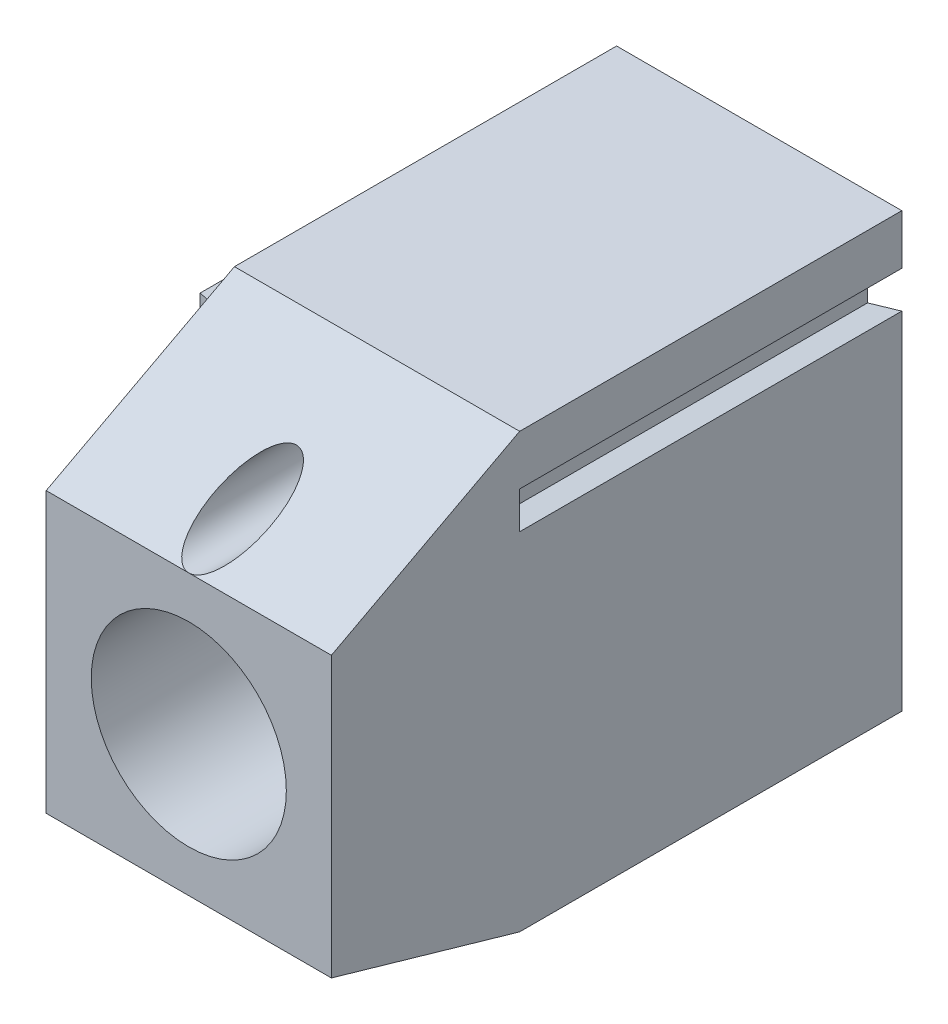
ISO-10303-21;
HEADER;
FILE_DESCRIPTION(('STEP AP214'),'2;1');
FILE_NAME('part.step','',(''),(''),'','','');
FILE_SCHEMA(('AUTOMOTIVE_DESIGN { 1 0 10303 214 1 1 1 1 }'));
ENDSEC;
DATA;
#1=APPLICATION_CONTEXT('core data for automotive mechanical design processes');
#2=APPLICATION_PROTOCOL_DEFINITION('international standard','automotive_design',2000,#1);
#3=PRODUCT_CONTEXT('',#1,'mechanical');
#4=PRODUCT('Part','Part','',(#3));
#5=PRODUCT_RELATED_PRODUCT_CATEGORY('part','',(#4));
#6=PRODUCT_DEFINITION_FORMATION('','',#4);
#7=PRODUCT_DEFINITION_CONTEXT('part definition',#1,'design');
#8=PRODUCT_DEFINITION('design','',#6,#7);
#9=PRODUCT_DEFINITION_SHAPE('','',#8);
#10=(LENGTH_UNIT() NAMED_UNIT(*) SI_UNIT(.MILLI.,.METRE.));
#11=(NAMED_UNIT(*) PLANE_ANGLE_UNIT() SI_UNIT($,.RADIAN.));
#12=(NAMED_UNIT(*) SI_UNIT($,.STERADIAN.) SOLID_ANGLE_UNIT());
#13=UNCERTAINTY_MEASURE_WITH_UNIT(LENGTH_MEASURE(1.E-05),#10,'distance_accuracy_value','');
#14=(GEOMETRIC_REPRESENTATION_CONTEXT(3) GLOBAL_UNCERTAINTY_ASSIGNED_CONTEXT((#13)) GLOBAL_UNIT_ASSIGNED_CONTEXT((#10,
#11,#12)) REPRESENTATION_CONTEXT('',''));
#15=CARTESIAN_POINT('',(0.,0.,0.));
#16=DIRECTION('',(0.,0.,1.));
#17=DIRECTION('',(1.,0.,0.));
#18=AXIS2_PLACEMENT_3D('',#15,#16,#17);
#19=CARTESIAN_POINT('',(1.42,-3.4,5.79));
#20=DIRECTION('',(1.,0.,0.));
#21=DIRECTION('',(0.,0.,-1.));
#22=AXIS2_PLACEMENT_3D('',#19,#20,#21);
#23=PLANE('',#22);
#24=DIRECTION('',(0.,1.,0.));
#25=VECTOR('',#24,1.);
#26=CARTESIAN_POINT('',(1.42,-3.4,5.79000000000001));
#27=LINE('',#26,#25);
#28=CARTESIAN_POINT('',(1.42,3.3,5.79));
#29=VERTEX_POINT('',#28);
#30=CARTESIAN_POINT('',(1.42,2.07,5.79000000000001));
#31=VERTEX_POINT('',#30);
#32=EDGE_CURVE('E275',#29,#31,#27,.F.);
#33=ORIENTED_EDGE('',*,*,#32,.F.);
#34=DIRECTION('',(0.,0.,-1.));
#35=VECTOR('',#34,1.);
#36=CARTESIAN_POINT('',(1.42,3.3,3.315));
#37=LINE('',#36,#35);
#38=CARTESIAN_POINT('',(1.42,3.3,0.840000000000001));
#39=VERTEX_POINT('',#38);
#40=EDGE_CURVE('E184',#39,#29,#37,.F.);
#41=ORIENTED_EDGE('',*,*,#40,.F.);
#42=DIRECTION('',(0.,1.,0.));
#43=VECTOR('',#42,1.);
#44=CARTESIAN_POINT('',(1.42,-3.4,0.840000000000002));
#45=LINE('',#44,#43);
#46=CARTESIAN_POINT('',(1.42,2.07,0.840000000000002));
#47=VERTEX_POINT('',#46);
#48=EDGE_CURVE('E273',#47,#39,#45,.T.);
#49=ORIENTED_EDGE('',*,*,#48,.F.);
#50=DIRECTION('',(0.,0.,1.));
#51=VECTOR('',#50,1.);
#52=CARTESIAN_POINT('',(1.42,2.07,3.315));
#53=LINE('',#52,#51);
#54=EDGE_CURVE('E233',#47,#31,#53,.T.);
#55=ORIENTED_EDGE('',*,*,#54,.T.);
#56=EDGE_LOOP('',(#33,#41,#49,#55));
#57=FACE_BOUND('',#56,.T.);
#58=ADVANCED_FACE('F16',(#57),#23,.F.);
#59=CARTESIAN_POINT('',(-1.42,-3.4,0.84));
#60=DIRECTION('',(-1.,0.,0.));
#61=DIRECTION('',(0.,0.,1.));
#62=AXIS2_PLACEMENT_3D('',#59,#60,#61);
#63=PLANE('',#62);
#64=DIRECTION('',(0.,1.,0.));
#65=VECTOR('',#64,1.);
#66=CARTESIAN_POINT('',(-1.42,-3.4,0.840000000000003));
#67=LINE('',#66,#65);
#68=CARTESIAN_POINT('',(-1.42,3.3,0.840000000000002));
#69=VERTEX_POINT('',#68);
#70=CARTESIAN_POINT('',(-1.42,2.07,0.840000000000003));
#71=VERTEX_POINT('',#70);
#72=EDGE_CURVE('E288',#69,#71,#67,.F.);
#73=ORIENTED_EDGE('',*,*,#72,.F.);
#74=DIRECTION('',(0.,0.,-1.));
#75=VECTOR('',#74,1.);
#76=CARTESIAN_POINT('',(-1.42,3.3,3.315));
#77=LINE('',#76,#75);
#78=CARTESIAN_POINT('',(-1.42,3.3,5.79));
#79=VERTEX_POINT('',#78);
#80=EDGE_CURVE('E183',#79,#69,#77,.T.);
#81=ORIENTED_EDGE('',*,*,#80,.F.);
#82=DIRECTION('',(0.,1.,0.));
#83=VECTOR('',#82,1.);
#84=CARTESIAN_POINT('',(-1.42,-3.4,5.79));
#85=LINE('',#84,#83);
#86=CARTESIAN_POINT('',(-1.42,2.07,5.79));
#87=VERTEX_POINT('',#86);
#88=EDGE_CURVE('E194',#87,#79,#85,.T.);
#89=ORIENTED_EDGE('',*,*,#88,.F.);
#90=DIRECTION('',(0.,0.,1.));
#91=VECTOR('',#90,1.);
#92=CARTESIAN_POINT('',(-1.42,2.07,3.315));
#93=LINE('',#92,#91);
#94=EDGE_CURVE('E234',#87,#71,#93,.F.);
#95=ORIENTED_EDGE('',*,*,#94,.T.);
#96=EDGE_LOOP('',(#73,#81,#89,#95));
#97=FACE_BOUND('',#96,.T.);
#98=ADVANCED_FACE('F583',(#97),#63,.F.);
#99=CARTESIAN_POINT('',(1.9,3.5,0.));
#100=DIRECTION('',(-1.,0.,0.));
#101=DIRECTION('',(0.,0.,1.));
#102=AXIS2_PLACEMENT_3D('',#99,#100,#101);
#103=PLANE('',#102);
#104=DIRECTION('',(0.,0.,1.));
#105=VECTOR('',#104,1.);
#106=CARTESIAN_POINT('',(1.9,3.5,0.));
#107=LINE('',#106,#105);
#108=CARTESIAN_POINT('',(1.9,3.5,0.));
#109=VERTEX_POINT('',#108);
#110=CARTESIAN_POINT('',(1.9,3.5,6.7));
#111=VERTEX_POINT('',#110);
#112=EDGE_CURVE('E303',#109,#111,#107,.T.);
#113=ORIENTED_EDGE('',*,*,#112,.T.);
#114=DIRECTION('',(0.,1.,0.));
#115=VECTOR('',#114,1.);
#116=CARTESIAN_POINT('',(1.9,3.5,6.7));
#117=LINE('',#116,#115);
#118=CARTESIAN_POINT('',(1.9,2.5,6.7));
#119=VERTEX_POINT('',#118);
#120=EDGE_CURVE('E291',#119,#111,#117,.T.);
#121=ORIENTED_EDGE('',*,*,#120,.F.);
#122=DIRECTION('',(0.,0.,1.));
#123=VECTOR('',#122,1.);
#124=CARTESIAN_POINT('',(1.9,2.5,0.));
#125=LINE('',#124,#123);
#126=CARTESIAN_POINT('',(1.9,2.5,0.));
#127=VERTEX_POINT('',#126);
#128=EDGE_CURVE('E264',#119,#127,#125,.F.);
#129=ORIENTED_EDGE('',*,*,#128,.T.);
#130=DIRECTION('',(0.,1.,0.));
#131=VECTOR('',#130,1.);
#132=CARTESIAN_POINT('',(1.9,3.5,0.));
#133=LINE('',#132,#131);
#134=EDGE_CURVE('E255',#109,#127,#133,.F.);
#135=ORIENTED_EDGE('',*,*,#134,.F.);
#136=EDGE_LOOP('',(#113,#121,#129,#135));
#137=FACE_BOUND('',#136,.T.);
#138=ADVANCED_FACE('F581',(#137),#103,.F.);
#139=CARTESIAN_POINT('',(0.,2.95,5.79));
#140=DIRECTION('',(0.,0.,1.));
#141=DIRECTION('',(1.,0.,0.));
#142=AXIS2_PLACEMENT_3D('',#139,#140,#141);
#143=PLANE('',#142);
#144=DIRECTION('',(1.,0.,0.));
#145=VECTOR('',#144,1.);
#146=CARTESIAN_POINT('',(0.,3.3,5.79000000000001));
#147=LINE('',#146,#145);
#148=CARTESIAN_POINT('',(0.357071421427143,3.3,5.79000000000001));
#149=VERTEX_POINT('',#148);
#150=CARTESIAN_POINT('',(-0.357071421427143,3.3,5.79000000000001));
#151=VERTEX_POINT('',#150);
#152=EDGE_CURVE('E173',#149,#151,#147,.F.);
#153=ORIENTED_EDGE('',*,*,#152,.F.);
#154=CARTESIAN_POINT('',(0.,2.95,5.79000000000001));
#155=DIRECTION('',(0.,0.,-1.));
#156=DIRECTION('',(-1.,0.,0.));
#157=AXIS2_PLACEMENT_3D('',#154,#155,#156);
#158=CIRCLE('',#157,0.5);
#159=EDGE_CURVE('E19',#149,#151,#158,.F.);
#160=ORIENTED_EDGE('',*,*,#159,.T.);
#161=EDGE_LOOP('',(#153,#160));
#162=FACE_BOUND('',#161,.T.);
#163=ADVANCED_FACE('F186',(#162),#143,.T.);
#164=CARTESIAN_POINT('',(0.,2.07,3.315));
#165=DIRECTION('',(0.,1.,0.));
#166=DIRECTION('',(0.,0.,1.));
#167=AXIS2_PLACEMENT_3D('',#164,#165,#166);
#168=PLANE('',#167);
#169=DIRECTION('',(1.,0.,0.));
#170=VECTOR('',#169,1.);
#171=CARTESIAN_POINT('',(0.,2.07,5.79));
#172=LINE('',#171,#170);
#173=CARTESIAN_POINT('',(-2.02,2.07,5.79));
#174=VERTEX_POINT('',#173);
#175=EDGE_CURVE('E245',#174,#87,#172,.T.);
#176=ORIENTED_EDGE('',*,*,#175,.F.);
#177=DIRECTION('',(0.,0.,1.));
#178=VECTOR('',#177,1.);
#179=CARTESIAN_POINT('',(-2.02,2.07,0.839999999999999));
#180=LINE('',#179,#178);
#181=CARTESIAN_POINT('',(-2.02,2.07,0.840000000000001));
#182=VERTEX_POINT('',#181);
#183=EDGE_CURVE('E200',#174,#182,#180,.F.);
#184=ORIENTED_EDGE('',*,*,#183,.T.);
#185=DIRECTION('',(1.,0.,0.));
#186=VECTOR('',#185,1.);
#187=CARTESIAN_POINT('',(0.,2.07,0.840000000000001));
#188=LINE('',#187,#186);
#189=EDGE_CURVE('E247',#71,#182,#188,.F.);
#190=ORIENTED_EDGE('',*,*,#189,.F.);
#191=ORIENTED_EDGE('',*,*,#94,.F.);
#192=EDGE_LOOP('',(#176,#184,#190,#191));
#193=FACE_BOUND('',#192,.T.);
#194=ADVANCED_FACE('F574',(#193),#168,.F.);
#195=CARTESIAN_POINT('',(0.,0.,6.10000000096989));
#196=DIRECTION('',(0.,0.,1.));
#197=DIRECTION('',(1.,0.,0.));
#198=AXIS2_PLACEMENT_3D('',#195,#196,#197);
#199=CONICAL_SURFACE('',#198,1.7099999992638,1.0297442574662);
#200=CARTESIAN_POINT('',(0.,0.,6.1));
#201=DIRECTION('',(0.,0.,1.));
#202=DIRECTION('',(1.,0.,0.));
#203=AXIS2_PLACEMENT_3D('',#200,#201,#202);
#204=CIRCLE('',#203,1.71);
#205=CARTESIAN_POINT('',(1.71,0.,6.1));
#206=VERTEX_POINT('',#205);
#207=EDGE_CURVE('E187',#206,#206,#204,.T.);
#208=ORIENTED_EDGE('',*,*,#207,.T.);
#209=EDGE_LOOP('',(#208));
#210=FACE_BOUND('',#209,.T.);
#211=CARTESIAN_POINT('',(0.,0.,5.79000000042247));
#212=DIRECTION('',(0.,0.,1.));
#213=DIRECTION('',(1.,0.,0.));
#214=AXIS2_PLACEMENT_3D('',#211,#212,#213);
#215=CIRCLE('',#214,1.19407336023869);
#216=CARTESIAN_POINT('',(1.19407336023869,0.,5.79000000042247));
#217=VERTEX_POINT('',#216);
#218=EDGE_CURVE('E203',#217,#217,#215,.F.);
#219=ORIENTED_EDGE('',*,*,#218,.T.);
#220=EDGE_LOOP('',(#219));
#221=FACE_BOUND('',#220,.T.);
#222=ADVANCED_FACE('F570',(#210,#221),#199,.F.);
#223=CARTESIAN_POINT('',(0.,2.07,3.315));
#224=DIRECTION('',(0.,1.,0.));
#225=DIRECTION('',(0.,0.,1.));
#226=AXIS2_PLACEMENT_3D('',#223,#224,#225);
#227=PLANE('',#226);
#228=DIRECTION('',(1.,0.,0.));
#229=VECTOR('',#228,1.);
#230=CARTESIAN_POINT('',(0.,2.07,0.840000000000002));
#231=LINE('',#230,#229);
#232=CARTESIAN_POINT('',(2.02,2.07,0.840000000000001));
#233=VERTEX_POINT('',#232);
#234=EDGE_CURVE('E230',#233,#47,#231,.F.);
#235=ORIENTED_EDGE('',*,*,#234,.F.);
#236=DIRECTION('',(0.,0.,-1.));
#237=VECTOR('',#236,1.);
#238=CARTESIAN_POINT('',(2.02,2.07,5.79));
#239=LINE('',#238,#237);
#240=CARTESIAN_POINT('',(2.02,2.07,5.79));
#241=VERTEX_POINT('',#240);
#242=EDGE_CURVE('E206',#233,#241,#239,.F.);
#243=ORIENTED_EDGE('',*,*,#242,.T.);
#244=DIRECTION('',(1.,0.,0.));
#245=VECTOR('',#244,1.);
#246=CARTESIAN_POINT('',(-2.02,2.07,5.79));
#247=LINE('',#246,#245);
#248=EDGE_CURVE('E207',#241,#31,#247,.F.);
#249=ORIENTED_EDGE('',*,*,#248,.T.);
#250=ORIENTED_EDGE('',*,*,#54,.F.);
#251=EDGE_LOOP('',(#235,#243,#249,#250));
#252=FACE_BOUND('',#251,.T.);
#253=ADVANCED_FACE('F567',(#252),#227,.F.);
#254=CARTESIAN_POINT('',(0.,3.3,3.315));
#255=DIRECTION('',(0.,-1.,0.));
#256=DIRECTION('',(0.,0.,-1.));
#257=AXIS2_PLACEMENT_3D('',#254,#255,#256);
#258=PLANE('',#257);
#259=DIRECTION('',(1.,0.,0.));
#260=VECTOR('',#259,1.);
#261=CARTESIAN_POINT('',(-2.02,3.3,5.79));
#262=LINE('',#261,#260);
#263=EDGE_CURVE('E177',#151,#79,#262,.F.);
#264=ORIENTED_EDGE('',*,*,#263,.T.);
#265=ORIENTED_EDGE('',*,*,#80,.T.);
#266=DIRECTION('',(-1.,0.,0.));
#267=VECTOR('',#266,1.);
#268=CARTESIAN_POINT('',(2.02,3.3,0.84));
#269=LINE('',#268,#267);
#270=EDGE_CURVE('E281',#69,#39,#269,.F.);
#271=ORIENTED_EDGE('',*,*,#270,.T.);
#272=ORIENTED_EDGE('',*,*,#40,.T.);
#273=DIRECTION('',(1.,0.,0.));
#274=VECTOR('',#273,1.);
#275=CARTESIAN_POINT('',(-2.02,3.3,5.79));
#276=LINE('',#275,#274);
#277=EDGE_CURVE('E180',#29,#149,#276,.F.);
#278=ORIENTED_EDGE('',*,*,#277,.T.);
#279=ORIENTED_EDGE('',*,*,#152,.T.);
#280=EDGE_LOOP('',(#264,#265,#271,#272,#278,#279));
#281=FACE_BOUND('',#280,.T.);
#282=ADVANCED_FACE('F174',(#281),#258,.T.);
#283=CARTESIAN_POINT('',(2.5,3.325,0.));
#284=DIRECTION('',(0.28,0.96,0.));
#285=DIRECTION('',(-0.96,0.28,0.));
#286=AXIS2_PLACEMENT_3D('',#283,#284,#285);
#287=PLANE('',#286);
#288=DIRECTION('',(0.,0.,-1.));
#289=VECTOR('',#288,1.);
#290=CARTESIAN_POINT('',(2.5,3.325,4.64944070137429));
#291=LINE('',#290,#289);
#292=CARTESIAN_POINT('',(2.5,3.325,6.7));
#293=VERTEX_POINT('',#292);
#294=CARTESIAN_POINT('',(2.5,3.325,0.));
#295=VERTEX_POINT('',#294);
#296=EDGE_CURVE('E328',#293,#295,#291,.T.);
#297=ORIENTED_EDGE('',*,*,#296,.F.);
#298=DIRECTION('',(0.96,-0.280000000000002,0.));
#299=VECTOR('',#298,1.);
#300=CARTESIAN_POINT('',(1.9,3.5,6.7));
#301=LINE('',#300,#299);
#302=EDGE_CURVE('E188',#111,#293,#301,.T.);
#303=ORIENTED_EDGE('',*,*,#302,.F.);
#304=ORIENTED_EDGE('',*,*,#112,.F.);
#305=DIRECTION('',(-0.96,0.28,0.));
#306=VECTOR('',#305,1.);
#307=CARTESIAN_POINT('',(2.5,3.325,0.));
#308=LINE('',#307,#306);
#309=EDGE_CURVE('E267',#295,#109,#308,.T.);
#310=ORIENTED_EDGE('',*,*,#309,.F.);
#311=EDGE_LOOP('',(#297,#303,#304,#310));
#312=FACE_BOUND('',#311,.T.);
#313=ADVANCED_FACE('F560',(#312),#287,.F.);
#314=CARTESIAN_POINT('',(1.9,2.5,0.));
#315=DIRECTION('',(0.28,-0.96,0.));
#316=DIRECTION('',(0.96,0.28,0.));
#317=AXIS2_PLACEMENT_3D('',#314,#315,#316);
#318=PLANE('',#317);
#319=ORIENTED_EDGE('',*,*,#128,.F.);
#320=DIRECTION('',(-0.96,-0.280000000000002,0.));
#321=VECTOR('',#320,1.);
#322=CARTESIAN_POINT('',(2.5,2.675,6.7));
#323=LINE('',#322,#321);
#324=CARTESIAN_POINT('',(2.5,2.675,6.7));
#325=VERTEX_POINT('',#324);
#326=EDGE_CURVE('E258',#325,#119,#323,.T.);
#327=ORIENTED_EDGE('',*,*,#326,.F.);
#328=DIRECTION('',(0.,0.,-1.));
#329=VECTOR('',#328,1.);
#330=CARTESIAN_POINT('',(2.5,2.675,4.64944070137429));
#331=LINE('',#330,#329);
#332=CARTESIAN_POINT('',(2.5,2.675,0.));
#333=VERTEX_POINT('',#332);
#334=EDGE_CURVE('E321',#333,#325,#331,.F.);
#335=ORIENTED_EDGE('',*,*,#334,.F.);
#336=DIRECTION('',(0.96,0.28,0.));
#337=VECTOR('',#336,1.);
#338=CARTESIAN_POINT('',(1.9,2.5,0.));
#339=LINE('',#338,#337);
#340=EDGE_CURVE('E261',#127,#333,#339,.T.);
#341=ORIENTED_EDGE('',*,*,#340,.F.);
#342=EDGE_LOOP('',(#319,#327,#335,#341));
#343=FACE_BOUND('',#342,.T.);
#344=ADVANCED_FACE('F556',(#343),#318,.F.);
#345=CARTESIAN_POINT('',(2.16379310344828,3.,6.7));
#346=DIRECTION('',(0.,0.,-1.));
#347=DIRECTION('',(-1.,0.,0.));
#348=AXIS2_PLACEMENT_3D('',#345,#346,#347);
#349=PLANE('',#348);
#350=ORIENTED_EDGE('',*,*,#120,.T.);
#351=ORIENTED_EDGE('',*,*,#302,.T.);
#352=DIRECTION('',(0.,1.,0.));
#353=VECTOR('',#352,1.);
#354=CARTESIAN_POINT('',(2.5,0.325842033366135,6.7));
#355=LINE('',#354,#353);
#356=EDGE_CURVE('E317',#325,#293,#355,.T.);
#357=ORIENTED_EDGE('',*,*,#356,.F.);
#358=ORIENTED_EDGE('',*,*,#326,.T.);
#359=EDGE_LOOP('',(#350,#351,#357,#358));
#360=FACE_BOUND('',#359,.T.);
#361=ADVANCED_FACE('F553',(#360),#349,.T.);
#362=CARTESIAN_POINT('',(0.,2.95,10.));
#363=DIRECTION('',(0.,0.,-1.));
#364=DIRECTION('',(-1.,0.,0.));
#365=AXIS2_PLACEMENT_3D('',#362,#363,#364);
#366=CYLINDRICAL_SURFACE('',#365,0.5);
#367=ORIENTED_EDGE('',*,*,#159,.F.);
#368=CARTESIAN_POINT('',(0.,2.95,5.79000000000001));
#369=DIRECTION('',(0.,0.,-1.));
#370=DIRECTION('',(-1.,0.,0.));
#371=AXIS2_PLACEMENT_3D('',#368,#369,#370);
#372=CIRCLE('',#371,0.5);
#373=EDGE_CURVE('E192',#149,#151,#372,.T.);
#374=ORIENTED_EDGE('',*,*,#373,.T.);
#375=EDGE_LOOP('',(#367,#374));
#376=FACE_BOUND('',#375,.T.);
#377=CARTESIAN_POINT('',(0.,2.95,9.05714285714286));
#378=DIRECTION('',(0.,0.883462102068378,0.468502629884746));
#379=DIRECTION('',(0.,0.468502629884746,-0.883462102068378));
#380=AXIS2_PLACEMENT_3D('',#377,#378,#379);
#381=ELLIPSE('',#380,1.06722986832113,0.5);
#382=CARTESIAN_POINT('',(0.,3.45,8.11428571428572));
#383=VERTEX_POINT('',#382);
#384=EDGE_CURVE('E213',#383,#383,#381,.F.);
#385=ORIENTED_EDGE('',*,*,#384,.F.);
#386=EDGE_LOOP('',(#385));
#387=FACE_BOUND('',#386,.T.);
#388=ADVANCED_FACE('F198',(#376,#387),#366,.F.);
#389=CARTESIAN_POINT('',(0.,0.,8.05));
#390=DIRECTION('',(0.,0.,1.));
#391=DIRECTION('',(1.,0.,0.));
#392=AXIS2_PLACEMENT_3D('',#389,#390,#391);
#393=CYLINDRICAL_SURFACE('',#392,1.71);
#394=ORIENTED_EDGE('',*,*,#207,.F.);
#395=EDGE_LOOP('',(#394));
#396=FACE_BOUND('',#395,.T.);
#397=CARTESIAN_POINT('',(0.,0.,10.));
#398=DIRECTION('',(0.,0.,1.));
#399=DIRECTION('',(1.,0.,0.));
#400=AXIS2_PLACEMENT_3D('',#397,#398,#399);
#401=CIRCLE('',#400,1.71);
#402=CARTESIAN_POINT('',(1.71,0.,10.));
#403=VERTEX_POINT('',#402);
#404=EDGE_CURVE('E219',#403,#403,#401,.F.);
#405=ORIENTED_EDGE('',*,*,#404,.F.);
#406=EDGE_LOOP('',(#405));
#407=FACE_BOUND('',#406,.T.);
#408=ADVANCED_FACE('F546',(#396,#407),#393,.F.);
#409=CARTESIAN_POINT('',(-2.02,-3.4,0.839999999999999));
#410=DIRECTION('',(-1.,0.,0.));
#411=DIRECTION('',(0.,0.,1.));
#412=AXIS2_PLACEMENT_3D('',#409,#410,#411);
#413=PLANE('',#412);
#414=DIRECTION('',(0.,1.,0.));
#415=VECTOR('',#414,1.);
#416=CARTESIAN_POINT('',(-2.02,-3.4,0.84));
#417=LINE('',#416,#415);
#418=CARTESIAN_POINT('',(-2.02,-3.4,0.840000000000001));
#419=VERTEX_POINT('',#418);
#420=EDGE_CURVE('E285',#419,#182,#417,.T.);
#421=ORIENTED_EDGE('',*,*,#420,.T.);
#422=ORIENTED_EDGE('',*,*,#183,.F.);
#423=DIRECTION('',(0.,1.,0.));
#424=VECTOR('',#423,1.);
#425=CARTESIAN_POINT('',(-2.02,-3.4,5.79));
#426=LINE('',#425,#424);
#427=CARTESIAN_POINT('',(-2.02,-3.4,5.79));
#428=VERTEX_POINT('',#427);
#429=EDGE_CURVE('E196',#174,#428,#426,.F.);
#430=ORIENTED_EDGE('',*,*,#429,.T.);
#431=DIRECTION('',(0.,0.,-1.));
#432=VECTOR('',#431,1.);
#433=CARTESIAN_POINT('',(-2.02,-3.4,6.7));
#434=LINE('',#433,#432);
#435=EDGE_CURVE('E437',#419,#428,#434,.F.);
#436=ORIENTED_EDGE('',*,*,#435,.F.);
#437=EDGE_LOOP('',(#421,#422,#430,#436));
#438=FACE_BOUND('',#437,.T.);
#439=ADVANCED_FACE('F542',(#438),#413,.F.);
#440=CARTESIAN_POINT('',(-2.02,-3.4,5.79));
#441=DIRECTION('',(0.,0.,1.));
#442=DIRECTION('',(1.,0.,0.));
#443=AXIS2_PLACEMENT_3D('',#440,#441,#442);
#444=PLANE('',#443);
#445=ORIENTED_EDGE('',*,*,#218,.F.);
#446=EDGE_LOOP('',(#445));
#447=FACE_BOUND('',#446,.T.);
#448=DIRECTION('',(0.,1.,0.));
#449=VECTOR('',#448,1.);
#450=CARTESIAN_POINT('',(2.02,-3.4,5.79));
#451=LINE('',#450,#449);
#452=CARTESIAN_POINT('',(2.02,-3.4,5.79));
#453=VERTEX_POINT('',#452);
#454=EDGE_CURVE('E361',#241,#453,#451,.F.);
#455=ORIENTED_EDGE('',*,*,#454,.T.);
#456=DIRECTION('',(1.,0.,0.));
#457=VECTOR('',#456,1.);
#458=CARTESIAN_POINT('',(0.,-3.4,5.79));
#459=LINE('',#458,#457);
#460=EDGE_CURVE('E439',#428,#453,#459,.T.);
#461=ORIENTED_EDGE('',*,*,#460,.F.);
#462=ORIENTED_EDGE('',*,*,#429,.F.);
#463=ORIENTED_EDGE('',*,*,#175,.T.);
#464=ORIENTED_EDGE('',*,*,#88,.T.);
#465=ORIENTED_EDGE('',*,*,#263,.F.);
#466=ORIENTED_EDGE('',*,*,#373,.F.);
#467=ORIENTED_EDGE('',*,*,#277,.F.);
#468=ORIENTED_EDGE('',*,*,#32,.T.);
#469=ORIENTED_EDGE('',*,*,#248,.F.);
#470=EDGE_LOOP('',(#455,#461,#462,#463,#464,#465,#466,#467,#468,#469));
#471=FACE_BOUND('',#470,.T.);
#472=ADVANCED_FACE('F191',(#447,#471),#444,.F.);
#473=CARTESIAN_POINT('',(2.02,-3.4,5.79));
#474=DIRECTION('',(1.,0.,0.));
#475=DIRECTION('',(0.,0.,-1.));
#476=AXIS2_PLACEMENT_3D('',#473,#474,#475);
#477=PLANE('',#476);
#478=ORIENTED_EDGE('',*,*,#454,.F.);
#479=ORIENTED_EDGE('',*,*,#242,.F.);
#480=DIRECTION('',(0.,1.,0.));
#481=VECTOR('',#480,1.);
#482=CARTESIAN_POINT('',(2.02,-3.4,0.84));
#483=LINE('',#482,#481);
#484=CARTESIAN_POINT('',(2.02,-3.4,0.84));
#485=VERTEX_POINT('',#484);
#486=EDGE_CURVE('E284',#233,#485,#483,.F.);
#487=ORIENTED_EDGE('',*,*,#486,.T.);
#488=DIRECTION('',(0.,0.,-1.));
#489=VECTOR('',#488,1.);
#490=CARTESIAN_POINT('',(2.02,-3.4,6.7));
#491=LINE('',#490,#489);
#492=EDGE_CURVE('E441',#453,#485,#491,.T.);
#493=ORIENTED_EDGE('',*,*,#492,.F.);
#494=EDGE_LOOP('',(#478,#479,#487,#493));
#495=FACE_BOUND('',#494,.T.);
#496=ADVANCED_FACE('F535',(#495),#477,.F.);
#497=CARTESIAN_POINT('',(2.02,-3.4,0.84));
#498=DIRECTION('',(0.,0.,-1.));
#499=DIRECTION('',(-1.,0.,0.));
#500=AXIS2_PLACEMENT_3D('',#497,#498,#499);
#501=PLANE('',#500);
#502=ORIENTED_EDGE('',*,*,#486,.F.);
#503=ORIENTED_EDGE('',*,*,#234,.T.);
#504=ORIENTED_EDGE('',*,*,#48,.T.);
#505=ORIENTED_EDGE('',*,*,#270,.F.);
#506=ORIENTED_EDGE('',*,*,#72,.T.);
#507=ORIENTED_EDGE('',*,*,#189,.T.);
#508=ORIENTED_EDGE('',*,*,#420,.F.);
#509=DIRECTION('',(1.,0.,0.));
#510=VECTOR('',#509,1.);
#511=CARTESIAN_POINT('',(0.,-3.4,0.840000000000001));
#512=LINE('',#511,#510);
#513=EDGE_CURVE('E443',#485,#419,#512,.F.);
#514=ORIENTED_EDGE('',*,*,#513,.F.);
#515=EDGE_LOOP('',(#502,#503,#504,#505,#506,#507,#508,#514));
#516=FACE_BOUND('',#515,.T.);
#517=ADVANCED_FACE('F531',(#516),#501,.F.);
#518=CARTESIAN_POINT('',(2.5,0.325842033366135,4.64944070137429));
#519=DIRECTION('',(1.,0.,0.));
#520=DIRECTION('',(0.,0.,-1.));
#521=AXIS2_PLACEMENT_3D('',#518,#519,#520);
#522=PLANE('',#521);
#523=ORIENTED_EDGE('',*,*,#334,.T.);
#524=ORIENTED_EDGE('',*,*,#356,.T.);
#525=ORIENTED_EDGE('',*,*,#296,.T.);
#526=DIRECTION('',(0.,1.,0.));
#527=VECTOR('',#526,1.);
#528=CARTESIAN_POINT('',(2.5,0.325842033366135,0.));
#529=LINE('',#528,#527);
#530=CARTESIAN_POINT('',(2.5,4.2,0.));
#531=VERTEX_POINT('',#530);
#532=EDGE_CURVE('E331',#295,#531,#529,.T.);
#533=ORIENTED_EDGE('',*,*,#532,.T.);
#534=DIRECTION('',(0.,0.,1.));
#535=VECTOR('',#534,1.);
#536=CARTESIAN_POINT('',(2.5,4.2,0.));
#537=LINE('',#536,#535);
#538=CARTESIAN_POINT('',(2.5,4.2,6.7));
#539=VERTEX_POINT('',#538);
#540=EDGE_CURVE('E211',#539,#531,#537,.F.);
#541=ORIENTED_EDGE('',*,*,#540,.F.);
#542=DIRECTION('',(0.,-0.468502629884746,0.883462102068378));
#543=VECTOR('',#542,1.);
#544=CARTESIAN_POINT('',(2.5,4.2,6.7));
#545=LINE('',#544,#543);
#546=CARTESIAN_POINT('',(2.5,2.45,10.));
#547=VERTEX_POINT('',#546);
#548=EDGE_CURVE('E208',#547,#539,#545,.F.);
#549=ORIENTED_EDGE('',*,*,#548,.F.);
#550=DIRECTION('',(0.,1.,0.));
#551=VECTOR('',#550,1.);
#552=CARTESIAN_POINT('',(2.5,2.45,10.));
#553=LINE('',#552,#551);
#554=CARTESIAN_POINT('',(2.5,-2.45,10.));
#555=VERTEX_POINT('',#554);
#556=EDGE_CURVE('E216',#555,#547,#553,.T.);
#557=ORIENTED_EDGE('',*,*,#556,.F.);
#558=DIRECTION('',(0.,-0.276643622505969,-0.960972583441783));
#559=VECTOR('',#558,1.);
#560=CARTESIAN_POINT('',(2.5,-2.45,10.));
#561=LINE('',#560,#559);
#562=CARTESIAN_POINT('',(2.5,-3.4,6.7));
#563=VERTEX_POINT('',#562);
#564=EDGE_CURVE('E222',#563,#555,#561,.F.);
#565=ORIENTED_EDGE('',*,*,#564,.F.);
#566=DIRECTION('',(0.,0.,-1.));
#567=VECTOR('',#566,1.);
#568=CARTESIAN_POINT('',(2.5,-3.4,6.7));
#569=LINE('',#568,#567);
#570=CARTESIAN_POINT('',(2.5,-3.4,0.));
#571=VERTEX_POINT('',#570);
#572=EDGE_CURVE('E339',#571,#563,#569,.F.);
#573=ORIENTED_EDGE('',*,*,#572,.F.);
#574=DIRECTION('',(0.,1.,0.));
#575=VECTOR('',#574,1.);
#576=CARTESIAN_POINT('',(2.5,0.,0.));
#577=LINE('',#576,#575);
#578=EDGE_CURVE('E446',#333,#571,#577,.F.);
#579=ORIENTED_EDGE('',*,*,#578,.F.);
#580=EDGE_LOOP('',(#523,#524,#525,#533,#541,#549,#557,#565,#573,#579));
#581=FACE_BOUND('',#580,.T.);
#582=ADVANCED_FACE('F527',(#581),#522,.T.);
#583=CARTESIAN_POINT('',(-3.1,3.5,0.));
#584=DIRECTION('',(-1.,0.,0.));
#585=DIRECTION('',(0.,0.,1.));
#586=AXIS2_PLACEMENT_3D('',#583,#584,#585);
#587=PLANE('',#586);
#588=DIRECTION('',(0.,1.,0.));
#589=VECTOR('',#588,1.);
#590=CARTESIAN_POINT('',(-3.1,3.,6.7));
#591=LINE('',#590,#589);
#592=CARTESIAN_POINT('',(-3.1,2.5,6.7));
#593=VERTEX_POINT('',#592);
#594=CARTESIAN_POINT('',(-3.1,3.5,6.7));
#595=VERTEX_POINT('',#594);
#596=EDGE_CURVE('E320',#593,#595,#591,.T.);
#597=ORIENTED_EDGE('',*,*,#596,.T.);
#598=DIRECTION('',(0.,0.,1.));
#599=VECTOR('',#598,1.);
#600=CARTESIAN_POINT('',(-3.1,3.5,0.));
#601=LINE('',#600,#599);
#602=CARTESIAN_POINT('',(-3.1,3.5,0.));
#603=VERTEX_POINT('',#602);
#604=EDGE_CURVE('E381',#603,#595,#601,.T.);
#605=ORIENTED_EDGE('',*,*,#604,.F.);
#606=DIRECTION('',(0.,1.,0.));
#607=VECTOR('',#606,1.);
#608=CARTESIAN_POINT('',(-3.1,0.,0.));
#609=LINE('',#608,#607);
#610=CARTESIAN_POINT('',(-3.1,2.5,0.));
#611=VERTEX_POINT('',#610);
#612=EDGE_CURVE('E375',#611,#603,#609,.T.);
#613=ORIENTED_EDGE('',*,*,#612,.F.);
#614=DIRECTION('',(0.,0.,1.));
#615=VECTOR('',#614,1.);
#616=CARTESIAN_POINT('',(-3.1,2.5,0.));
#617=LINE('',#616,#615);
#618=EDGE_CURVE('E390',#593,#611,#617,.F.);
#619=ORIENTED_EDGE('',*,*,#618,.F.);
#620=EDGE_LOOP('',(#597,#605,#613,#619));
#621=FACE_BOUND('',#620,.T.);
#622=ADVANCED_FACE('F524',(#621),#587,.T.);
#623=CARTESIAN_POINT('',(-2.83620689655173,3.,6.7));
#624=DIRECTION('',(0.,0.,-1.));
#625=DIRECTION('',(-1.,0.,0.));
#626=AXIS2_PLACEMENT_3D('',#623,#624,#625);
#627=PLANE('',#626);
#628=DIRECTION('',(-0.96,0.28,0.));
#629=VECTOR('',#628,1.);
#630=CARTESIAN_POINT('',(-2.5,3.325,6.7));
#631=LINE('',#630,#629);
#632=CARTESIAN_POINT('',(-2.5,3.325,6.7));
#633=VERTEX_POINT('',#632);
#634=EDGE_CURVE('E383',#595,#633,#631,.F.);
#635=ORIENTED_EDGE('',*,*,#634,.F.);
#636=ORIENTED_EDGE('',*,*,#596,.F.);
#637=DIRECTION('',(0.96,0.28,0.));
#638=VECTOR('',#637,1.);
#639=CARTESIAN_POINT('',(-3.1,2.5,6.7));
#640=LINE('',#639,#638);
#641=CARTESIAN_POINT('',(-2.5,2.675,6.7));
#642=VERTEX_POINT('',#641);
#643=EDGE_CURVE('E371',#642,#593,#640,.F.);
#644=ORIENTED_EDGE('',*,*,#643,.F.);
#645=DIRECTION('',(0.,1.,0.));
#646=VECTOR('',#645,1.);
#647=CARTESIAN_POINT('',(-2.5,0.325842033366135,6.7));
#648=LINE('',#647,#646);
#649=EDGE_CURVE('E392',#642,#633,#648,.T.);
#650=ORIENTED_EDGE('',*,*,#649,.T.);
#651=EDGE_LOOP('',(#635,#636,#644,#650));
#652=FACE_BOUND('',#651,.T.);
#653=ADVANCED_FACE('F493',(#652),#627,.F.);
#654=CARTESIAN_POINT('',(-2.5,3.325,0.));
#655=DIRECTION('',(0.28,0.96,0.));
#656=DIRECTION('',(-0.96,0.28,0.));
#657=AXIS2_PLACEMENT_3D('',#654,#655,#656);
#658=PLANE('',#657);
#659=ORIENTED_EDGE('',*,*,#634,.T.);
#660=DIRECTION('',(0.,0.,-1.));
#661=VECTOR('',#660,1.);
#662=CARTESIAN_POINT('',(-2.5,3.325,4.64944070137429));
#663=LINE('',#662,#661);
#664=CARTESIAN_POINT('',(-2.5,3.325,0.));
#665=VERTEX_POINT('',#664);
#666=EDGE_CURVE('E407',#633,#665,#663,.T.);
#667=ORIENTED_EDGE('',*,*,#666,.T.);
#668=DIRECTION('',(0.96,-0.279999999999999,0.));
#669=VECTOR('',#668,1.);
#670=CARTESIAN_POINT('',(-3.1,3.5,0.));
#671=LINE('',#670,#669);
#672=EDGE_CURVE('E377',#603,#665,#671,.T.);
#673=ORIENTED_EDGE('',*,*,#672,.F.);
#674=ORIENTED_EDGE('',*,*,#604,.T.);
#675=EDGE_LOOP('',(#659,#667,#673,#674));
#676=FACE_BOUND('',#675,.T.);
#677=ADVANCED_FACE('F489',(#676),#658,.T.);
#678=CARTESIAN_POINT('',(0.,4.2,0.));
#679=DIRECTION('',(0.,1.,0.));
#680=DIRECTION('',(0.,0.,1.));
#681=AXIS2_PLACEMENT_3D('',#678,#679,#680);
#682=PLANE('',#681);
#683=DIRECTION('',(-1.,0.,0.));
#684=VECTOR('',#683,1.);
#685=CARTESIAN_POINT('',(0.,4.2,0.));
#686=LINE('',#685,#684);
#687=CARTESIAN_POINT('',(-2.5,4.2,0.));
#688=VERTEX_POINT('',#687);
#689=EDGE_CURVE('E372',#688,#531,#686,.F.);
#690=ORIENTED_EDGE('',*,*,#689,.F.);
#691=DIRECTION('',(0.,0.,-1.));
#692=VECTOR('',#691,1.);
#693=CARTESIAN_POINT('',(-2.5,4.2,4.64944070137429));
#694=LINE('',#693,#692);
#695=CARTESIAN_POINT('',(-2.5,4.2,6.7));
#696=VERTEX_POINT('',#695);
#697=EDGE_CURVE('E227',#688,#696,#694,.F.);
#698=ORIENTED_EDGE('',*,*,#697,.T.);
#699=DIRECTION('',(1.,0.,0.));
#700=VECTOR('',#699,1.);
#701=CARTESIAN_POINT('',(0.,4.2,6.7));
#702=LINE('',#701,#700);
#703=EDGE_CURVE('E210',#539,#696,#702,.F.);
#704=ORIENTED_EDGE('',*,*,#703,.F.);
#705=ORIENTED_EDGE('',*,*,#540,.T.);
#706=EDGE_LOOP('',(#690,#698,#704,#705));
#707=FACE_BOUND('',#706,.T.);
#708=ADVANCED_FACE('F484',(#707),#682,.T.);
#709=CARTESIAN_POINT('',(0.,4.2,6.7));
#710=DIRECTION('',(0.,0.883462102068378,0.468502629884746));
#711=DIRECTION('',(0.,-0.468502629884746,0.883462102068378));
#712=AXIS2_PLACEMENT_3D('',#709,#710,#711);
#713=PLANE('',#712);
#714=ORIENTED_EDGE('',*,*,#384,.T.);
#715=EDGE_LOOP('',(#714));
#716=FACE_BOUND('',#715,.T.);
#717=ORIENTED_EDGE('',*,*,#703,.T.);
#718=DIRECTION('',(0.,-0.468502629884746,0.883462102068378));
#719=VECTOR('',#718,1.);
#720=CARTESIAN_POINT('',(-2.5,4.2,6.7));
#721=LINE('',#720,#719);
#722=CARTESIAN_POINT('',(-2.5,2.45,10.));
#723=VERTEX_POINT('',#722);
#724=EDGE_CURVE('E223',#696,#723,#721,.T.);
#725=ORIENTED_EDGE('',*,*,#724,.T.);
#726=DIRECTION('',(1.,0.,0.));
#727=VECTOR('',#726,1.);
#728=CARTESIAN_POINT('',(0.,2.45,10.));
#729=LINE('',#728,#727);
#730=EDGE_CURVE('E217',#547,#723,#729,.F.);
#731=ORIENTED_EDGE('',*,*,#730,.F.);
#732=ORIENTED_EDGE('',*,*,#548,.T.);
#733=EDGE_LOOP('',(#717,#725,#731,#732));
#734=FACE_BOUND('',#733,.T.);
#735=ADVANCED_FACE('F478',(#716,#734),#713,.T.);
#736=CARTESIAN_POINT('',(0.,2.45,10.));
#737=DIRECTION('',(0.,0.,1.));
#738=DIRECTION('',(1.,0.,0.));
#739=AXIS2_PLACEMENT_3D('',#736,#737,#738);
#740=PLANE('',#739);
#741=ORIENTED_EDGE('',*,*,#404,.T.);
#742=EDGE_LOOP('',(#741));
#743=FACE_BOUND('',#742,.T.);
#744=ORIENTED_EDGE('',*,*,#730,.T.);
#745=DIRECTION('',(0.,1.,0.));
#746=VECTOR('',#745,1.);
#747=CARTESIAN_POINT('',(-2.5,0.325842033366135,10.));
#748=LINE('',#747,#746);
#749=CARTESIAN_POINT('',(-2.5,-2.45,10.));
#750=VERTEX_POINT('',#749);
#751=EDGE_CURVE('E226',#723,#750,#748,.F.);
#752=ORIENTED_EDGE('',*,*,#751,.T.);
#753=DIRECTION('',(1.,0.,0.));
#754=VECTOR('',#753,1.);
#755=CARTESIAN_POINT('',(0.,-2.45,10.));
#756=LINE('',#755,#754);
#757=EDGE_CURVE('E337',#555,#750,#756,.F.);
#758=ORIENTED_EDGE('',*,*,#757,.F.);
#759=ORIENTED_EDGE('',*,*,#556,.T.);
#760=EDGE_LOOP('',(#744,#752,#758,#759));
#761=FACE_BOUND('',#760,.T.);
#762=ADVANCED_FACE('F475',(#743,#761),#740,.T.);
#763=CARTESIAN_POINT('',(0.,-2.45,10.));
#764=DIRECTION('',(0.,-0.960972583441783,0.276643622505969));
#765=DIRECTION('',(0.,-0.276643622505969,-0.960972583441783));
#766=AXIS2_PLACEMENT_3D('',#763,#764,#765);
#767=PLANE('',#766);
#768=ORIENTED_EDGE('',*,*,#757,.T.);
#769=DIRECTION('',(0.,-0.276643622505968,-0.960972583441783));
#770=VECTOR('',#769,1.);
#771=CARTESIAN_POINT('',(-2.5,-2.45,10.));
#772=LINE('',#771,#770);
#773=CARTESIAN_POINT('',(-2.5,-3.4,6.7));
#774=VERTEX_POINT('',#773);
#775=EDGE_CURVE('E429',#750,#774,#772,.T.);
#776=ORIENTED_EDGE('',*,*,#775,.T.);
#777=DIRECTION('',(1.,0.,0.));
#778=VECTOR('',#777,1.);
#779=CARTESIAN_POINT('',(0.,-3.4,6.7));
#780=LINE('',#779,#778);
#781=EDGE_CURVE('E435',#563,#774,#780,.F.);
#782=ORIENTED_EDGE('',*,*,#781,.F.);
#783=ORIENTED_EDGE('',*,*,#564,.T.);
#784=EDGE_LOOP('',(#768,#776,#782,#783));
#785=FACE_BOUND('',#784,.T.);
#786=ADVANCED_FACE('F469',(#785),#767,.T.);
#787=CARTESIAN_POINT('',(0.,-3.4,6.7));
#788=DIRECTION('',(0.,-1.,0.));
#789=DIRECTION('',(0.,0.,-1.));
#790=AXIS2_PLACEMENT_3D('',#787,#788,#789);
#791=PLANE('',#790);
#792=ORIENTED_EDGE('',*,*,#492,.T.);
#793=ORIENTED_EDGE('',*,*,#513,.T.);
#794=ORIENTED_EDGE('',*,*,#435,.T.);
#795=ORIENTED_EDGE('',*,*,#460,.T.);
#796=EDGE_LOOP('',(#792,#793,#794,#795));
#797=FACE_BOUND('',#796,.T.);
#798=ORIENTED_EDGE('',*,*,#781,.T.);
#799=DIRECTION('',(0.,0.,-1.));
#800=VECTOR('',#799,1.);
#801=CARTESIAN_POINT('',(-2.5,-3.4,4.64944070137429));
#802=LINE('',#801,#800);
#803=CARTESIAN_POINT('',(-2.5,-3.4,0.));
#804=VERTEX_POINT('',#803);
#805=EDGE_CURVE('E451',#774,#804,#802,.T.);
#806=ORIENTED_EDGE('',*,*,#805,.T.);
#807=DIRECTION('',(-1.,0.,0.));
#808=VECTOR('',#807,1.);
#809=CARTESIAN_POINT('',(0.,-3.4,0.));
#810=LINE('',#809,#808);
#811=EDGE_CURVE('E378',#571,#804,#810,.T.);
#812=ORIENTED_EDGE('',*,*,#811,.F.);
#813=ORIENTED_EDGE('',*,*,#572,.T.);
#814=EDGE_LOOP('',(#798,#806,#812,#813));
#815=FACE_BOUND('',#814,.T.);
#816=ADVANCED_FACE('F464',(#797,#815),#791,.T.);
#817=CARTESIAN_POINT('',(0.,0.,0.));
#818=DIRECTION('',(0.,0.,-1.));
#819=DIRECTION('',(-1.,0.,0.));
#820=AXIS2_PLACEMENT_3D('',#817,#818,#819);
#821=PLANE('',#820);
#822=ORIENTED_EDGE('',*,*,#689,.T.);
#823=ORIENTED_EDGE('',*,*,#532,.F.);
#824=ORIENTED_EDGE('',*,*,#309,.T.);
#825=ORIENTED_EDGE('',*,*,#134,.T.);
#826=ORIENTED_EDGE('',*,*,#340,.T.);
#827=ORIENTED_EDGE('',*,*,#578,.T.);
#828=ORIENTED_EDGE('',*,*,#811,.T.);
#829=DIRECTION('',(0.,1.,0.));
#830=VECTOR('',#829,1.);
#831=CARTESIAN_POINT('',(-2.5,0.325842033366135,0.));
#832=LINE('',#831,#830);
#833=CARTESIAN_POINT('',(-2.5,2.675,0.));
#834=VERTEX_POINT('',#833);
#835=EDGE_CURVE('E25',#804,#834,#832,.T.);
#836=ORIENTED_EDGE('',*,*,#835,.T.);
#837=DIRECTION('',(0.96,0.28,0.));
#838=VECTOR('',#837,1.);
#839=CARTESIAN_POINT('',(-3.1,2.5,0.));
#840=LINE('',#839,#838);
#841=EDGE_CURVE('E33',#611,#834,#840,.T.);
#842=ORIENTED_EDGE('',*,*,#841,.F.);
#843=ORIENTED_EDGE('',*,*,#612,.T.);
#844=ORIENTED_EDGE('',*,*,#672,.T.);
#845=DIRECTION('',(0.,1.,0.));
#846=VECTOR('',#845,1.);
#847=CARTESIAN_POINT('',(-2.5,0.325842033366135,0.));
#848=LINE('',#847,#846);
#849=EDGE_CURVE('E415',#665,#688,#848,.T.);
#850=ORIENTED_EDGE('',*,*,#849,.T.);
#851=EDGE_LOOP('',(#822,#823,#824,#825,#826,#827,#828,#836,#842,#843,#844,#850));
#852=FACE_BOUND('',#851,.T.);
#853=ADVANCED_FACE('F457',(#852),#821,.T.);
#854=CARTESIAN_POINT('',(-3.1,2.5,0.));
#855=DIRECTION('',(0.28,-0.96,0.));
#856=DIRECTION('',(0.96,0.28,0.));
#857=AXIS2_PLACEMENT_3D('',#854,#855,#856);
#858=PLANE('',#857);
#859=ORIENTED_EDGE('',*,*,#643,.T.);
#860=ORIENTED_EDGE('',*,*,#618,.T.);
#861=ORIENTED_EDGE('',*,*,#841,.T.);
#862=DIRECTION('',(0.,0.,-1.));
#863=VECTOR('',#862,1.);
#864=CARTESIAN_POINT('',(-2.5,2.675,4.64944070137429));
#865=LINE('',#864,#863);
#866=EDGE_CURVE('E10',#834,#642,#865,.F.);
#867=ORIENTED_EDGE('',*,*,#866,.T.);
#868=EDGE_LOOP('',(#859,#860,#861,#867));
#869=FACE_BOUND('',#868,.T.);
#870=ADVANCED_FACE('F496',(#869),#858,.T.);
#871=CARTESIAN_POINT('',(-2.5,0.325842033366135,4.64944070137429));
#872=DIRECTION('',(1.,0.,0.));
#873=DIRECTION('',(0.,0.,-1.));
#874=AXIS2_PLACEMENT_3D('',#871,#872,#873);
#875=PLANE('',#874);
#876=ORIENTED_EDGE('',*,*,#835,.F.);
#877=ORIENTED_EDGE('',*,*,#805,.F.);
#878=ORIENTED_EDGE('',*,*,#775,.F.);
#879=ORIENTED_EDGE('',*,*,#751,.F.);
#880=ORIENTED_EDGE('',*,*,#724,.F.);
#881=ORIENTED_EDGE('',*,*,#697,.F.);
#882=ORIENTED_EDGE('',*,*,#849,.F.);
#883=ORIENTED_EDGE('',*,*,#666,.F.);
#884=ORIENTED_EDGE('',*,*,#649,.F.);
#885=ORIENTED_EDGE('',*,*,#866,.F.);
#886=EDGE_LOOP('',(#876,#877,#878,#879,#880,#881,#882,#883,#884,#885));
#887=FACE_BOUND('',#886,.T.);
#888=ADVANCED_FACE('F461',(#887),#875,.F.);
#889=CLOSED_SHELL('',(#58,#98,#138,#163,#194,#222,#253,#282,#313,#344,#361,#388,#408,#439,#472,
#496,#517,#582,#622,#653,#677,#708,#735,#762,#786,#816,#853,#870,#888));
#890=MANIFOLD_SOLID_BREP('B1',#889);
#891=ADVANCED_BREP_SHAPE_REPRESENTATION('',(#18,#890),#14);
#892=SHAPE_DEFINITION_REPRESENTATION(#9,#891);
ENDSEC;
END-ISO-10303-21;
